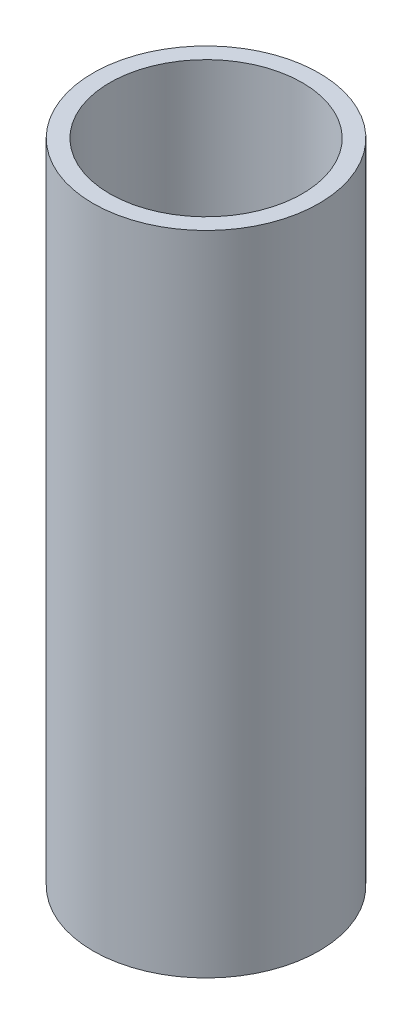
ISO-10303-21;
HEADER;
FILE_DESCRIPTION(('STEP AP214'),'2;1');
FILE_NAME('part.step','',(''),(''),'','','');
FILE_SCHEMA(('AUTOMOTIVE_DESIGN { 1 0 10303 214 1 1 1 1 }'));
ENDSEC;
DATA;
#1=APPLICATION_CONTEXT('core data for automotive mechanical design processes');
#2=APPLICATION_PROTOCOL_DEFINITION('international standard','automotive_design',2000,#1);
#3=PRODUCT_CONTEXT('',#1,'mechanical');
#4=PRODUCT('Part','Part','',(#3));
#5=PRODUCT_RELATED_PRODUCT_CATEGORY('part','',(#4));
#6=PRODUCT_DEFINITION_FORMATION('','',#4);
#7=PRODUCT_DEFINITION_CONTEXT('part definition',#1,'design');
#8=PRODUCT_DEFINITION('design','',#6,#7);
#9=PRODUCT_DEFINITION_SHAPE('','',#8);
#10=(LENGTH_UNIT() NAMED_UNIT(*) SI_UNIT(.MILLI.,.METRE.));
#11=(NAMED_UNIT(*) PLANE_ANGLE_UNIT() SI_UNIT($,.RADIAN.));
#12=(NAMED_UNIT(*) SI_UNIT($,.STERADIAN.) SOLID_ANGLE_UNIT());
#13=UNCERTAINTY_MEASURE_WITH_UNIT(LENGTH_MEASURE(1.E-05),#10,'distance_accuracy_value','');
#14=(GEOMETRIC_REPRESENTATION_CONTEXT(3) GLOBAL_UNCERTAINTY_ASSIGNED_CONTEXT((#13)) GLOBAL_UNIT_ASSIGNED_CONTEXT((#10,
#11,#12)) REPRESENTATION_CONTEXT('',''));
#15=CARTESIAN_POINT('',(0.,0.,0.));
#16=DIRECTION('',(0.,0.,1.));
#17=DIRECTION('',(1.,0.,0.));
#18=AXIS2_PLACEMENT_3D('',#15,#16,#17);
#19=CARTESIAN_POINT('',(0.,143.192905409385,0.));
#20=DIRECTION('',(0.,-1.,0.));
#21=DIRECTION('',(0.,0.,-1.));
#22=AXIS2_PLACEMENT_3D('',#19,#20,#21);
#23=CYLINDRICAL_SURFACE('',#22,25.);
#24=CARTESIAN_POINT('',(0.,143.192905409385,0.));
#25=DIRECTION('',(0.,1.,0.));
#26=DIRECTION('',(0.,0.,1.));
#27=AXIS2_PLACEMENT_3D('',#24,#25,#26);
#28=CIRCLE('',#27,25.);
#29=CARTESIAN_POINT('',(0.,143.192905409385,25.));
#30=VERTEX_POINT('',#29);
#31=EDGE_CURVE('E10',#30,#30,#28,.T.);
#32=ORIENTED_EDGE('',*,*,#31,.F.);
#33=EDGE_LOOP('',(#32));
#34=FACE_BOUND('',#33,.T.);
#35=CARTESIAN_POINT('',(0.,0.,0.));
#36=DIRECTION('',(0.,1.,0.));
#37=DIRECTION('',(0.,0.,1.));
#38=AXIS2_PLACEMENT_3D('',#35,#36,#37);
#39=CIRCLE('',#38,25.);
#40=CARTESIAN_POINT('',(0.,0.,25.));
#41=VERTEX_POINT('',#40);
#42=EDGE_CURVE('E37',#41,#41,#39,.T.);
#43=ORIENTED_EDGE('',*,*,#42,.T.);
#44=EDGE_LOOP('',(#43));
#45=FACE_BOUND('',#44,.T.);
#46=ADVANCED_FACE('F40',(#34,#45),#23,.T.);
#47=CARTESIAN_POINT('',(0.,143.192905409385,0.));
#48=DIRECTION('',(0.,1.,0.));
#49=DIRECTION('',(0.,0.,1.));
#50=AXIS2_PLACEMENT_3D('',#47,#48,#49);
#51=PLANE('',#50);
#52=CARTESIAN_POINT('',(0.,143.192905409385,0.));
#53=DIRECTION('',(0.,1.,0.));
#54=DIRECTION('',(0.,0.,1.));
#55=AXIS2_PLACEMENT_3D('',#52,#53,#54);
#56=CIRCLE('',#55,21.2966760697695);
#57=CARTESIAN_POINT('',(0.,143.192905409385,21.2966760697695));
#58=VERTEX_POINT('',#57);
#59=EDGE_CURVE('E50',#58,#58,#56,.T.);
#60=ORIENTED_EDGE('',*,*,#59,.F.);
#61=EDGE_LOOP('',(#60));
#62=FACE_BOUND('',#61,.T.);
#63=ORIENTED_EDGE('',*,*,#31,.T.);
#64=EDGE_LOOP('',(#63));
#65=FACE_BOUND('',#64,.T.);
#66=ADVANCED_FACE('F59',(#62,#65),#51,.T.);
#67=CARTESIAN_POINT('',(0.,0.,0.));
#68=DIRECTION('',(0.,1.,0.));
#69=DIRECTION('',(0.,0.,1.));
#70=AXIS2_PLACEMENT_3D('',#67,#68,#69);
#71=PLANE('',#70);
#72=CARTESIAN_POINT('',(0.,0.,0.));
#73=DIRECTION('',(0.,1.,0.));
#74=DIRECTION('',(0.,0.,1.));
#75=AXIS2_PLACEMENT_3D('',#72,#73,#74);
#76=CIRCLE('',#75,21.2966760697695);
#77=CARTESIAN_POINT('',(0.,0.,21.2966760697695));
#78=VERTEX_POINT('',#77);
#79=EDGE_CURVE('E47',#78,#78,#76,.T.);
#80=ORIENTED_EDGE('',*,*,#79,.T.);
#81=EDGE_LOOP('',(#80));
#82=FACE_BOUND('',#81,.T.);
#83=ORIENTED_EDGE('',*,*,#42,.F.);
#84=EDGE_LOOP('',(#83));
#85=FACE_BOUND('',#84,.T.);
#86=ADVANCED_FACE('F58',(#82,#85),#71,.F.);
#87=CARTESIAN_POINT('',(0.,143.192905409385,0.));
#88=DIRECTION('',(0.,-1.,0.));
#89=DIRECTION('',(0.,0.,-1.));
#90=AXIS2_PLACEMENT_3D('',#87,#88,#89);
#91=CYLINDRICAL_SURFACE('',#90,21.2966760697695);
#92=ORIENTED_EDGE('',*,*,#59,.T.);
#93=EDGE_LOOP('',(#92));
#94=FACE_BOUND('',#93,.T.);
#95=ORIENTED_EDGE('',*,*,#79,.F.);
#96=EDGE_LOOP('',(#95));
#97=FACE_BOUND('',#96,.T.);
#98=ADVANCED_FACE('F54',(#94,#97),#91,.F.);
#99=CLOSED_SHELL('',(#46,#66,#86,#98));
#100=MANIFOLD_SOLID_BREP('B2',#99);
#101=ADVANCED_BREP_SHAPE_REPRESENTATION('',(#18,#100),#14);
#102=SHAPE_DEFINITION_REPRESENTATION(#9,#101);
ENDSEC;
END-ISO-10303-21;
